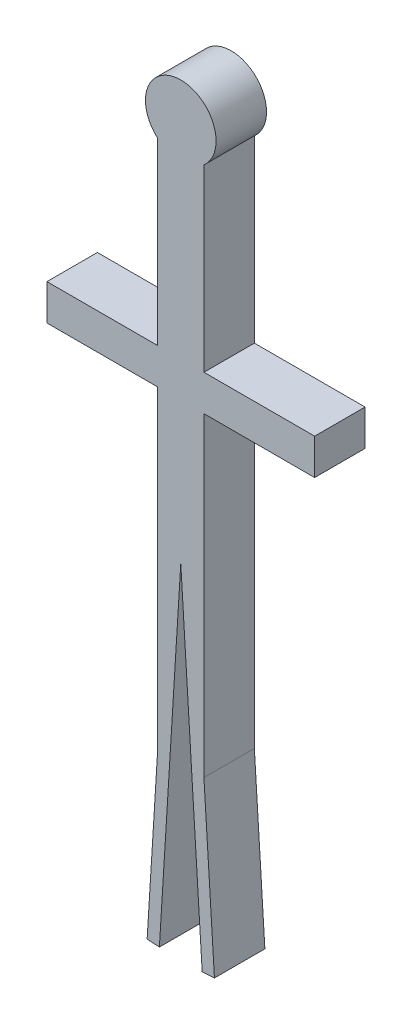
ISO-10303-21;
HEADER;
FILE_DESCRIPTION(('STEP AP214'),'2;1');
FILE_NAME('part.step','',(''),(''),'','','');
FILE_SCHEMA(('AUTOMOTIVE_DESIGN { 1 0 10303 214 1 1 1 1 }'));
ENDSEC;
DATA;
#1=APPLICATION_CONTEXT('core data for automotive mechanical design processes');
#2=APPLICATION_PROTOCOL_DEFINITION('international standard','automotive_design',2000,#1);
#3=PRODUCT_CONTEXT('',#1,'mechanical');
#4=PRODUCT('Part','Part','',(#3));
#5=PRODUCT_RELATED_PRODUCT_CATEGORY('part','',(#4));
#6=PRODUCT_DEFINITION_FORMATION('','',#4);
#7=PRODUCT_DEFINITION_CONTEXT('part definition',#1,'design');
#8=PRODUCT_DEFINITION('design','',#6,#7);
#9=PRODUCT_DEFINITION_SHAPE('','',#8);
#10=(LENGTH_UNIT() NAMED_UNIT(*) SI_UNIT(.MILLI.,.METRE.));
#11=(NAMED_UNIT(*) PLANE_ANGLE_UNIT() SI_UNIT($,.RADIAN.));
#12=(NAMED_UNIT(*) SI_UNIT($,.STERADIAN.) SOLID_ANGLE_UNIT());
#13=UNCERTAINTY_MEASURE_WITH_UNIT(LENGTH_MEASURE(1.E-05),#10,'distance_accuracy_value','');
#14=(GEOMETRIC_REPRESENTATION_CONTEXT(3) GLOBAL_UNCERTAINTY_ASSIGNED_CONTEXT((#13)) GLOBAL_UNIT_ASSIGNED_CONTEXT((#10,
#11,#12)) REPRESENTATION_CONTEXT('',''));
#15=CARTESIAN_POINT('',(0.,0.,0.));
#16=DIRECTION('',(0.,0.,1.));
#17=DIRECTION('',(1.,0.,0.));
#18=AXIS2_PLACEMENT_3D('',#15,#16,#17);
#19=CARTESIAN_POINT('',(0.,0.,127.));
#20=DIRECTION('',(0.,0.,-1.));
#21=DIRECTION('',(-1.,0.,0.));
#22=AXIS2_PLACEMENT_3D('',#19,#20,#21);
#23=CYLINDRICAL_SURFACE('',#22,88.9);
#24=CARTESIAN_POINT('',(0.,0.,0.));
#25=DIRECTION('',(0.,0.,1.));
#26=DIRECTION('',(1.,0.,0.));
#27=AXIS2_PLACEMENT_3D('',#24,#25,#26);
#28=CIRCLE('',#27,88.9);
#29=CARTESIAN_POINT('',(58.2726731385284,-67.1379591981335,0.));
#30=VERTEX_POINT('',#29);
#31=CARTESIAN_POINT('',(-58.2726731385284,-67.1379591981335,0.));
#32=VERTEX_POINT('',#31);
#33=EDGE_CURVE('E183',#30,#32,#28,.T.);
#34=ORIENTED_EDGE('',*,*,#33,.T.);
#35=DIRECTION('',(0.,0.,-1.));
#36=VECTOR('',#35,1.);
#37=CARTESIAN_POINT('',(-58.2726731385284,-67.1379591981335,127.));
#38=LINE('',#37,#36);
#39=CARTESIAN_POINT('',(-58.2726731385284,-67.1379591981335,127.));
#40=VERTEX_POINT('',#39);
#41=EDGE_CURVE('E11',#40,#32,#38,.T.);
#42=ORIENTED_EDGE('',*,*,#41,.F.);
#43=CARTESIAN_POINT('',(0.,0.,127.));
#44=DIRECTION('',(0.,0.,1.));
#45=DIRECTION('',(1.,0.,0.));
#46=AXIS2_PLACEMENT_3D('',#43,#44,#45);
#47=CIRCLE('',#46,88.9);
#48=CARTESIAN_POINT('',(58.2726731385284,-67.1379591981335,127.));
#49=VERTEX_POINT('',#48);
#50=EDGE_CURVE('E215',#49,#40,#47,.T.);
#51=ORIENTED_EDGE('',*,*,#50,.F.);
#52=DIRECTION('',(0.,0.,-1.));
#53=VECTOR('',#52,1.);
#54=CARTESIAN_POINT('',(58.2726731385284,-67.1379591981335,127.));
#55=LINE('',#54,#53);
#56=EDGE_CURVE('E179',#49,#30,#55,.T.);
#57=ORIENTED_EDGE('',*,*,#56,.T.);
#58=EDGE_LOOP('',(#34,#42,#51,#57));
#59=FACE_BOUND('',#58,.T.);
#60=ADVANCED_FACE('F33',(#59),#23,.T.);
#61=CARTESIAN_POINT('',(-58.2726731385284,-67.1379591981335,127.));
#62=DIRECTION('',(1.,0.,0.));
#63=DIRECTION('',(0.,0.,-1.));
#64=AXIS2_PLACEMENT_3D('',#61,#62,#63);
#65=PLANE('',#64);
#66=DIRECTION('',(0.,-1.,0.));
#67=VECTOR('',#66,1.);
#68=CARTESIAN_POINT('',(-58.2726731385284,-67.1379591981335,0.));
#69=LINE('',#68,#67);
#70=CARTESIAN_POINT('',(-58.2726731385284,-519.346809045541,0.));
#71=VERTEX_POINT('',#70);
#72=EDGE_CURVE('E186',#32,#71,#69,.T.);
#73=ORIENTED_EDGE('',*,*,#72,.T.);
#74=DIRECTION('',(0.,0.,-1.));
#75=VECTOR('',#74,1.);
#76=CARTESIAN_POINT('',(-58.2726731385284,-519.346809045541,127.));
#77=LINE('',#76,#75);
#78=CARTESIAN_POINT('',(-58.2726731385284,-519.346809045541,127.));
#79=VERTEX_POINT('',#78);
#80=EDGE_CURVE('E41',#79,#71,#77,.T.);
#81=ORIENTED_EDGE('',*,*,#80,.F.);
#82=DIRECTION('',(0.,-1.,0.));
#83=VECTOR('',#82,1.);
#84=CARTESIAN_POINT('',(-58.2726731385284,-67.1379591981335,127.));
#85=LINE('',#84,#83);
#86=EDGE_CURVE('E119',#40,#79,#85,.T.);
#87=ORIENTED_EDGE('',*,*,#86,.F.);
#88=ORIENTED_EDGE('',*,*,#41,.T.);
#89=EDGE_LOOP('',(#73,#81,#87,#88));
#90=FACE_BOUND('',#89,.T.);
#91=ADVANCED_FACE('F318',(#90),#65,.F.);
#92=CARTESIAN_POINT('',(-58.2726731385284,-519.346809045541,127.));
#93=DIRECTION('',(0.,-1.,0.));
#94=DIRECTION('',(0.,0.,-1.));
#95=AXIS2_PLACEMENT_3D('',#92,#93,#94);
#96=PLANE('',#95);
#97=DIRECTION('',(-1.,0.,0.));
#98=VECTOR('',#97,1.);
#99=CARTESIAN_POINT('',(-58.2726731385284,-519.346809045541,0.));
#100=LINE('',#99,#98);
#101=CARTESIAN_POINT('',(-336.974932068991,-519.346809045541,0.));
#102=VERTEX_POINT('',#101);
#103=EDGE_CURVE('E188',#71,#102,#100,.T.);
#104=ORIENTED_EDGE('',*,*,#103,.T.);
#105=DIRECTION('',(0.,0.,-1.));
#106=VECTOR('',#105,1.);
#107=CARTESIAN_POINT('',(-336.974932068991,-519.346809045541,127.));
#108=LINE('',#107,#106);
#109=CARTESIAN_POINT('',(-336.974932068991,-519.346809045541,127.));
#110=VERTEX_POINT('',#109);
#111=EDGE_CURVE('E249',#110,#102,#108,.T.);
#112=ORIENTED_EDGE('',*,*,#111,.F.);
#113=DIRECTION('',(-1.,0.,0.));
#114=VECTOR('',#113,1.);
#115=CARTESIAN_POINT('',(-58.2726731385284,-519.346809045541,127.));
#116=LINE('',#115,#114);
#117=EDGE_CURVE('E257',#79,#110,#116,.T.);
#118=ORIENTED_EDGE('',*,*,#117,.F.);
#119=ORIENTED_EDGE('',*,*,#80,.T.);
#120=EDGE_LOOP('',(#104,#112,#118,#119));
#121=FACE_BOUND('',#120,.T.);
#122=ADVANCED_FACE('F255',(#121),#96,.F.);
#123=CARTESIAN_POINT('',(-336.974932068991,-519.346809045541,127.));
#124=DIRECTION('',(1.,0.,0.));
#125=DIRECTION('',(0.,0.,-1.));
#126=AXIS2_PLACEMENT_3D('',#123,#124,#125);
#127=PLANE('',#126);
#128=DIRECTION('',(0.,-1.,0.));
#129=VECTOR('',#128,1.);
#130=CARTESIAN_POINT('',(-336.974932068991,-519.346809045541,0.));
#131=LINE('',#130,#129);
#132=CARTESIAN_POINT('',(-336.974932068991,-609.62196558978,0.));
#133=VERTEX_POINT('',#132);
#134=EDGE_CURVE('E190',#102,#133,#131,.T.);
#135=ORIENTED_EDGE('',*,*,#134,.T.);
#136=DIRECTION('',(0.,0.,-1.));
#137=VECTOR('',#136,1.);
#138=CARTESIAN_POINT('',(-336.974932068991,-609.62196558978,127.));
#139=LINE('',#138,#137);
#140=CARTESIAN_POINT('',(-336.974932068991,-609.62196558978,127.));
#141=VERTEX_POINT('',#140);
#142=EDGE_CURVE('E246',#141,#133,#139,.T.);
#143=ORIENTED_EDGE('',*,*,#142,.F.);
#144=DIRECTION('',(0.,-1.,0.));
#145=VECTOR('',#144,1.);
#146=CARTESIAN_POINT('',(-336.974932068991,-519.346809045541,127.));
#147=LINE('',#146,#145);
#148=EDGE_CURVE('E275',#110,#141,#147,.T.);
#149=ORIENTED_EDGE('',*,*,#148,.F.);
#150=ORIENTED_EDGE('',*,*,#111,.T.);
#151=EDGE_LOOP('',(#135,#143,#149,#150));
#152=FACE_BOUND('',#151,.T.);
#153=ADVANCED_FACE('F266',(#152),#127,.F.);
#154=CARTESIAN_POINT('',(-336.974932068991,-609.62196558978,127.));
#155=DIRECTION('',(0.,1.,0.));
#156=DIRECTION('',(0.,0.,1.));
#157=AXIS2_PLACEMENT_3D('',#154,#155,#156);
#158=PLANE('',#157);
#159=DIRECTION('',(1.,0.,0.));
#160=VECTOR('',#159,1.);
#161=CARTESIAN_POINT('',(-336.974932068991,-609.62196558978,0.));
#162=LINE('',#161,#160);
#163=CARTESIAN_POINT('',(-58.2726731385284,-609.62196558978,0.));
#164=VERTEX_POINT('',#163);
#165=EDGE_CURVE('E192',#133,#164,#162,.T.);
#166=ORIENTED_EDGE('',*,*,#165,.T.);
#167=DIRECTION('',(0.,0.,-1.));
#168=VECTOR('',#167,1.);
#169=CARTESIAN_POINT('',(-58.2726731385284,-609.62196558978,127.));
#170=LINE('',#169,#168);
#171=CARTESIAN_POINT('',(-58.2726731385284,-609.62196558978,127.));
#172=VERTEX_POINT('',#171);
#173=EDGE_CURVE('E243',#172,#164,#170,.T.);
#174=ORIENTED_EDGE('',*,*,#173,.F.);
#175=DIRECTION('',(1.,0.,0.));
#176=VECTOR('',#175,1.);
#177=CARTESIAN_POINT('',(-336.974932068991,-609.62196558978,127.));
#178=LINE('',#177,#176);
#179=EDGE_CURVE('E272',#141,#172,#178,.T.);
#180=ORIENTED_EDGE('',*,*,#179,.F.);
#181=ORIENTED_EDGE('',*,*,#142,.T.);
#182=EDGE_LOOP('',(#166,#174,#180,#181));
#183=FACE_BOUND('',#182,.T.);
#184=ADVANCED_FACE('F270',(#183),#158,.F.);
#185=CARTESIAN_POINT('',(-58.2726731385284,-609.62196558978,127.));
#186=DIRECTION('',(1.,0.,0.));
#187=DIRECTION('',(0.,1.,0.));
#188=AXIS2_PLACEMENT_3D('',#185,#186,#187);
#189=PLANE('',#188);
#190=DIRECTION('',(0.,-1.,0.));
#191=VECTOR('',#190,1.);
#192=CARTESIAN_POINT('',(-58.2726731385284,-609.62196558978,0.));
#193=LINE('',#192,#191);
#194=CARTESIAN_POINT('',(-58.2726731385282,-1403.11866405035,0.));
#195=VERTEX_POINT('',#194);
#196=EDGE_CURVE('E194',#164,#195,#193,.T.);
#197=ORIENTED_EDGE('',*,*,#196,.T.);
#198=DIRECTION('',(0.,0.,-1.));
#199=VECTOR('',#198,1.);
#200=CARTESIAN_POINT('',(-58.2726731385282,-1403.11866405035,127.));
#201=LINE('',#200,#199);
#202=CARTESIAN_POINT('',(-58.2726731385282,-1403.11866405035,127.));
#203=VERTEX_POINT('',#202);
#204=EDGE_CURVE('E240',#203,#195,#201,.T.);
#205=ORIENTED_EDGE('',*,*,#204,.F.);
#206=DIRECTION('',(0.,-1.,0.));
#207=VECTOR('',#206,1.);
#208=CARTESIAN_POINT('',(-58.2726731385284,-609.62196558978,127.));
#209=LINE('',#208,#207);
#210=EDGE_CURVE('E274',#172,#203,#209,.T.);
#211=ORIENTED_EDGE('',*,*,#210,.F.);
#212=ORIENTED_EDGE('',*,*,#173,.T.);
#213=EDGE_LOOP('',(#197,#205,#211,#212));
#214=FACE_BOUND('',#213,.T.);
#215=ADVANCED_FACE('F331',(#214),#189,.F.);
#216=CARTESIAN_POINT('',(-58.2726731385282,-1403.11866405035,127.));
#217=DIRECTION('',(0.998056580707022,-0.0623142175382735,0.));
#218=DIRECTION('',(0.0623142175382735,0.998056580707022,0.));
#219=AXIS2_PLACEMENT_3D('',#216,#217,#218);
#220=PLANE('',#219);
#221=DIRECTION('',(-0.0623142175382735,-0.998056580707022,0.));
#222=VECTOR('',#221,1.);
#223=CARTESIAN_POINT('',(-58.2726731385282,-1403.11866405035,0.));
#224=LINE('',#223,#222);
#225=CARTESIAN_POINT('',(-84.7301029401742,-1826.87447717451,0.));
#226=VERTEX_POINT('',#225);
#227=EDGE_CURVE('E196',#195,#226,#224,.T.);
#228=ORIENTED_EDGE('',*,*,#227,.T.);
#229=DIRECTION('',(0.,0.,-1.));
#230=VECTOR('',#229,1.);
#231=CARTESIAN_POINT('',(-84.7301029401742,-1826.87447717451,127.));
#232=LINE('',#231,#230);
#233=CARTESIAN_POINT('',(-84.7301029401742,-1826.87447717451,127.));
#234=VERTEX_POINT('',#233);
#235=EDGE_CURVE('E237',#234,#226,#232,.T.);
#236=ORIENTED_EDGE('',*,*,#235,.F.);
#237=DIRECTION('',(-0.0623142175382735,-0.998056580707022,0.));
#238=VECTOR('',#237,1.);
#239=CARTESIAN_POINT('',(-58.2726731385282,-1403.11866405035,127.));
#240=LINE('',#239,#238);
#241=EDGE_CURVE('E277',#203,#234,#240,.T.);
#242=ORIENTED_EDGE('',*,*,#241,.F.);
#243=ORIENTED_EDGE('',*,*,#204,.T.);
#244=EDGE_LOOP('',(#228,#236,#242,#243));
#245=FACE_BOUND('',#244,.T.);
#246=ADVANCED_FACE('F334',(#245),#220,.F.);
#247=CARTESIAN_POINT('',(-84.7301029401742,-1826.87447717451,127.));
#248=DIRECTION('',(0.0623142175382751,0.998056580707022,0.));
#249=DIRECTION('',(-0.998056580707022,0.0623142175382751,0.));
#250=AXIS2_PLACEMENT_3D('',#247,#248,#249);
#251=PLANE('',#250);
#252=DIRECTION('',(0.998056580707022,-0.0623142175382751,0.));
#253=VECTOR('',#252,1.);
#254=CARTESIAN_POINT('',(-84.7301029401742,-1826.87447717451,0.));
#255=LINE('',#254,#253);
#256=CARTESIAN_POINT('',(-53.8899383163327,-1828.8,0.));
#257=VERTEX_POINT('',#256);
#258=EDGE_CURVE('E198',#226,#257,#255,.T.);
#259=ORIENTED_EDGE('',*,*,#258,.T.);
#260=DIRECTION('',(0.,0.,-1.));
#261=VECTOR('',#260,1.);
#262=CARTESIAN_POINT('',(-53.8899383163327,-1828.8,127.));
#263=LINE('',#262,#261);
#264=CARTESIAN_POINT('',(-53.8899383163327,-1828.8,127.));
#265=VERTEX_POINT('',#264);
#266=EDGE_CURVE('E234',#265,#257,#263,.T.);
#267=ORIENTED_EDGE('',*,*,#266,.F.);
#268=DIRECTION('',(0.998056580707022,-0.0623142175382751,0.));
#269=VECTOR('',#268,1.);
#270=CARTESIAN_POINT('',(-84.7301029401742,-1826.87447717451,127.));
#271=LINE('',#270,#269);
#272=EDGE_CURVE('E283',#234,#265,#271,.T.);
#273=ORIENTED_EDGE('',*,*,#272,.F.);
#274=ORIENTED_EDGE('',*,*,#235,.T.);
#275=EDGE_LOOP('',(#259,#267,#273,#274));
#276=FACE_BOUND('',#275,.T.);
#277=ADVANCED_FACE('F338',(#276),#251,.F.);
#278=CARTESIAN_POINT('',(-53.8899383163327,-1828.8,127.));
#279=DIRECTION('',(-0.998056580707022,0.0623142175382737,0.));
#280=DIRECTION('',(-0.0623142175382737,-0.998056580707022,0.));
#281=AXIS2_PLACEMENT_3D('',#278,#279,#280);
#282=PLANE('',#281);
#283=DIRECTION('',(0.0623142175382737,0.998056580707022,0.));
#284=VECTOR('',#283,1.);
#285=CARTESIAN_POINT('',(-53.8899383163327,-1828.8,0.));
#286=LINE('',#285,#284);
#287=CARTESIAN_POINT('',(0.,-965.671011218647,0.));
#288=VERTEX_POINT('',#287);
#289=EDGE_CURVE('E200',#257,#288,#286,.T.);
#290=ORIENTED_EDGE('',*,*,#289,.T.);
#291=DIRECTION('',(0.,0.,-1.));
#292=VECTOR('',#291,1.);
#293=CARTESIAN_POINT('',(0.,-965.671011218647,127.));
#294=LINE('',#293,#292);
#295=CARTESIAN_POINT('',(0.,-965.671011218647,127.));
#296=VERTEX_POINT('',#295);
#297=EDGE_CURVE('E231',#296,#288,#294,.T.);
#298=ORIENTED_EDGE('',*,*,#297,.F.);
#299=DIRECTION('',(0.0623142175382737,0.998056580707022,0.));
#300=VECTOR('',#299,1.);
#301=CARTESIAN_POINT('',(-53.8899383163327,-1828.8,127.));
#302=LINE('',#301,#300);
#303=EDGE_CURVE('E285',#265,#296,#302,.T.);
#304=ORIENTED_EDGE('',*,*,#303,.F.);
#305=ORIENTED_EDGE('',*,*,#266,.T.);
#306=EDGE_LOOP('',(#290,#298,#304,#305));
#307=FACE_BOUND('',#306,.T.);
#308=ADVANCED_FACE('F342',(#307),#282,.F.);
#309=CARTESIAN_POINT('',(0.,-965.671011218647,127.));
#310=DIRECTION('',(0.998056580707022,0.0623142175382742,0.));
#311=DIRECTION('',(-0.0623142175382742,0.998056580707022,0.));
#312=AXIS2_PLACEMENT_3D('',#309,#310,#311);
#313=PLANE('',#312);
#314=DIRECTION('',(0.0623142175382742,-0.998056580707022,0.));
#315=VECTOR('',#314,1.);
#316=CARTESIAN_POINT('',(0.,-965.671011218647,0.));
#317=LINE('',#316,#315);
#318=CARTESIAN_POINT('',(53.8899383163332,-1828.8,0.));
#319=VERTEX_POINT('',#318);
#320=EDGE_CURVE('E202',#288,#319,#317,.T.);
#321=ORIENTED_EDGE('',*,*,#320,.T.);
#322=DIRECTION('',(0.,0.,-1.));
#323=VECTOR('',#322,1.);
#324=CARTESIAN_POINT('',(53.8899383163332,-1828.8,127.));
#325=LINE('',#324,#323);
#326=CARTESIAN_POINT('',(53.8899383163332,-1828.8,127.));
#327=VERTEX_POINT('',#326);
#328=EDGE_CURVE('E228',#327,#319,#325,.T.);
#329=ORIENTED_EDGE('',*,*,#328,.F.);
#330=DIRECTION('',(0.0623142175382742,-0.998056580707022,0.));
#331=VECTOR('',#330,1.);
#332=CARTESIAN_POINT('',(0.,-965.671011218647,127.));
#333=LINE('',#332,#331);
#334=EDGE_CURVE('E287',#296,#327,#333,.T.);
#335=ORIENTED_EDGE('',*,*,#334,.F.);
#336=ORIENTED_EDGE('',*,*,#297,.T.);
#337=EDGE_LOOP('',(#321,#329,#335,#336));
#338=FACE_BOUND('',#337,.T.);
#339=ADVANCED_FACE('F346',(#338),#313,.F.);
#340=CARTESIAN_POINT('',(53.8899383163332,-1828.8,127.));
#341=DIRECTION('',(-0.0623142175382761,0.998056580707022,0.));
#342=DIRECTION('',(-0.998056580707022,-0.0623142175382761,0.));
#343=AXIS2_PLACEMENT_3D('',#340,#341,#342);
#344=PLANE('',#343);
#345=DIRECTION('',(0.998056580707022,0.0623142175382761,0.));
#346=VECTOR('',#345,1.);
#347=CARTESIAN_POINT('',(53.8899383163332,-1828.8,0.));
#348=LINE('',#347,#346);
#349=CARTESIAN_POINT('',(84.7301029401742,-1826.87447717451,0.));
#350=VERTEX_POINT('',#349);
#351=EDGE_CURVE('E204',#319,#350,#348,.T.);
#352=ORIENTED_EDGE('',*,*,#351,.T.);
#353=DIRECTION('',(0.,0.,-1.));
#354=VECTOR('',#353,1.);
#355=CARTESIAN_POINT('',(84.7301029401742,-1826.87447717451,127.));
#356=LINE('',#355,#354);
#357=CARTESIAN_POINT('',(84.7301029401742,-1826.87447717451,127.));
#358=VERTEX_POINT('',#357);
#359=EDGE_CURVE('E225',#358,#350,#356,.T.);
#360=ORIENTED_EDGE('',*,*,#359,.F.);
#361=DIRECTION('',(0.998056580707022,0.0623142175382761,0.));
#362=VECTOR('',#361,1.);
#363=CARTESIAN_POINT('',(53.8899383163332,-1828.8,127.));
#364=LINE('',#363,#362);
#365=EDGE_CURVE('E289',#327,#358,#364,.T.);
#366=ORIENTED_EDGE('',*,*,#365,.F.);
#367=ORIENTED_EDGE('',*,*,#328,.T.);
#368=EDGE_LOOP('',(#352,#360,#366,#367));
#369=FACE_BOUND('',#368,.T.);
#370=ADVANCED_FACE('F350',(#369),#344,.F.);
#371=CARTESIAN_POINT('',(84.7301029401742,-1826.87447717451,127.));
#372=DIRECTION('',(-0.998056580707022,-0.0623142175382735,0.));
#373=DIRECTION('',(0.0623142175382735,-0.998056580707022,0.));
#374=AXIS2_PLACEMENT_3D('',#371,#372,#373);
#375=PLANE('',#374);
#376=DIRECTION('',(-0.0623142175382735,0.998056580707022,0.));
#377=VECTOR('',#376,1.);
#378=CARTESIAN_POINT('',(84.7301029401742,-1826.87447717451,0.));
#379=LINE('',#378,#377);
#380=CARTESIAN_POINT('',(58.2726731385282,-1403.11866405035,0.));
#381=VERTEX_POINT('',#380);
#382=EDGE_CURVE('E206',#350,#381,#379,.T.);
#383=ORIENTED_EDGE('',*,*,#382,.T.);
#384=DIRECTION('',(0.,0.,-1.));
#385=VECTOR('',#384,1.);
#386=CARTESIAN_POINT('',(58.2726731385282,-1403.11866405035,127.));
#387=LINE('',#386,#385);
#388=CARTESIAN_POINT('',(58.2726731385282,-1403.11866405035,127.));
#389=VERTEX_POINT('',#388);
#390=EDGE_CURVE('E222',#389,#381,#387,.T.);
#391=ORIENTED_EDGE('',*,*,#390,.F.);
#392=DIRECTION('',(-0.0623142175382735,0.998056580707022,0.));
#393=VECTOR('',#392,1.);
#394=CARTESIAN_POINT('',(84.7301029401742,-1826.87447717451,127.));
#395=LINE('',#394,#393);
#396=EDGE_CURVE('E291',#358,#389,#395,.T.);
#397=ORIENTED_EDGE('',*,*,#396,.F.);
#398=ORIENTED_EDGE('',*,*,#359,.T.);
#399=EDGE_LOOP('',(#383,#391,#397,#398));
#400=FACE_BOUND('',#399,.T.);
#401=ADVANCED_FACE('F354',(#400),#375,.F.);
#402=CARTESIAN_POINT('',(58.2726731385282,-1403.11866405035,127.));
#403=DIRECTION('',(-1.,0.,0.));
#404=DIRECTION('',(0.,-1.,0.));
#405=AXIS2_PLACEMENT_3D('',#402,#403,#404);
#406=PLANE('',#405);
#407=DIRECTION('',(0.,1.,0.));
#408=VECTOR('',#407,1.);
#409=CARTESIAN_POINT('',(58.2726731385282,-1403.11866405035,0.));
#410=LINE('',#409,#408);
#411=CARTESIAN_POINT('',(58.2726731385284,-609.62196558978,0.));
#412=VERTEX_POINT('',#411);
#413=EDGE_CURVE('E208',#381,#412,#410,.T.);
#414=ORIENTED_EDGE('',*,*,#413,.T.);
#415=DIRECTION('',(0.,0.,-1.));
#416=VECTOR('',#415,1.);
#417=CARTESIAN_POINT('',(58.2726731385284,-609.62196558978,127.));
#418=LINE('',#417,#416);
#419=CARTESIAN_POINT('',(58.2726731385284,-609.62196558978,127.));
#420=VERTEX_POINT('',#419);
#421=EDGE_CURVE('E219',#420,#412,#418,.T.);
#422=ORIENTED_EDGE('',*,*,#421,.F.);
#423=DIRECTION('',(0.,1.,0.));
#424=VECTOR('',#423,1.);
#425=CARTESIAN_POINT('',(58.2726731385282,-1403.11866405035,127.));
#426=LINE('',#425,#424);
#427=EDGE_CURVE('E293',#389,#420,#426,.T.);
#428=ORIENTED_EDGE('',*,*,#427,.F.);
#429=ORIENTED_EDGE('',*,*,#390,.T.);
#430=EDGE_LOOP('',(#414,#422,#428,#429));
#431=FACE_BOUND('',#430,.T.);
#432=ADVANCED_FACE('F299',(#431),#406,.F.);
#433=CARTESIAN_POINT('',(58.2726731385284,-609.62196558978,127.));
#434=DIRECTION('',(0.,1.,0.));
#435=DIRECTION('',(0.,0.,1.));
#436=AXIS2_PLACEMENT_3D('',#433,#434,#435);
#437=PLANE('',#436);
#438=DIRECTION('',(1.,0.,0.));
#439=VECTOR('',#438,1.);
#440=CARTESIAN_POINT('',(58.2726731385284,-609.62196558978,0.));
#441=LINE('',#440,#439);
#442=CARTESIAN_POINT('',(336.974932068991,-609.62196558978,0.));
#443=VERTEX_POINT('',#442);
#444=EDGE_CURVE('E210',#412,#443,#441,.T.);
#445=ORIENTED_EDGE('',*,*,#444,.T.);
#446=DIRECTION('',(0.,0.,-1.));
#447=VECTOR('',#446,1.);
#448=CARTESIAN_POINT('',(336.974932068991,-609.62196558978,127.));
#449=LINE('',#448,#447);
#450=CARTESIAN_POINT('',(336.974932068991,-609.62196558978,127.));
#451=VERTEX_POINT('',#450);
#452=EDGE_CURVE('E174',#451,#443,#449,.T.);
#453=ORIENTED_EDGE('',*,*,#452,.F.);
#454=DIRECTION('',(1.,0.,0.));
#455=VECTOR('',#454,1.);
#456=CARTESIAN_POINT('',(58.2726731385284,-609.62196558978,127.));
#457=LINE('',#456,#455);
#458=EDGE_CURVE('E165',#420,#451,#457,.T.);
#459=ORIENTED_EDGE('',*,*,#458,.F.);
#460=ORIENTED_EDGE('',*,*,#421,.T.);
#461=EDGE_LOOP('',(#445,#453,#459,#460));
#462=FACE_BOUND('',#461,.T.);
#463=ADVANCED_FACE('F303',(#462),#437,.F.);
#464=CARTESIAN_POINT('',(336.974932068991,-609.62196558978,127.));
#465=DIRECTION('',(-1.,0.,0.));
#466=DIRECTION('',(0.,0.,1.));
#467=AXIS2_PLACEMENT_3D('',#464,#465,#466);
#468=PLANE('',#467);
#469=DIRECTION('',(0.,1.,0.));
#470=VECTOR('',#469,1.);
#471=CARTESIAN_POINT('',(336.974932068991,-609.62196558978,0.));
#472=LINE('',#471,#470);
#473=CARTESIAN_POINT('',(336.974932068991,-519.346809045541,0.));
#474=VERTEX_POINT('',#473);
#475=EDGE_CURVE('E173',#443,#474,#472,.T.);
#476=ORIENTED_EDGE('',*,*,#475,.T.);
#477=DIRECTION('',(0.,0.,-1.));
#478=VECTOR('',#477,1.);
#479=CARTESIAN_POINT('',(336.974932068991,-519.346809045541,127.));
#480=LINE('',#479,#478);
#481=CARTESIAN_POINT('',(336.974932068991,-519.346809045541,127.));
#482=VERTEX_POINT('',#481);
#483=EDGE_CURVE('E170',#482,#474,#480,.T.);
#484=ORIENTED_EDGE('',*,*,#483,.F.);
#485=DIRECTION('',(0.,1.,0.));
#486=VECTOR('',#485,1.);
#487=CARTESIAN_POINT('',(336.974932068991,-609.62196558978,127.));
#488=LINE('',#487,#486);
#489=EDGE_CURVE('E159',#451,#482,#488,.T.);
#490=ORIENTED_EDGE('',*,*,#489,.F.);
#491=ORIENTED_EDGE('',*,*,#452,.T.);
#492=EDGE_LOOP('',(#476,#484,#490,#491));
#493=FACE_BOUND('',#492,.T.);
#494=ADVANCED_FACE('F171',(#493),#468,.F.);
#495=CARTESIAN_POINT('',(336.974932068991,-519.346809045541,127.));
#496=DIRECTION('',(0.,-1.,0.));
#497=DIRECTION('',(0.,0.,-1.));
#498=AXIS2_PLACEMENT_3D('',#495,#496,#497);
#499=PLANE('',#498);
#500=DIRECTION('',(-1.,0.,0.));
#501=VECTOR('',#500,1.);
#502=CARTESIAN_POINT('',(336.974932068991,-519.346809045541,0.));
#503=LINE('',#502,#501);
#504=CARTESIAN_POINT('',(58.2726731385284,-519.346809045541,0.));
#505=VERTEX_POINT('',#504);
#506=EDGE_CURVE('E105',#474,#505,#503,.T.);
#507=ORIENTED_EDGE('',*,*,#506,.T.);
#508=DIRECTION('',(0.,0.,-1.));
#509=VECTOR('',#508,1.);
#510=CARTESIAN_POINT('',(58.2726731385284,-519.346809045541,127.));
#511=LINE('',#510,#509);
#512=CARTESIAN_POINT('',(58.2726731385284,-519.346809045541,127.));
#513=VERTEX_POINT('',#512);
#514=EDGE_CURVE('E175',#513,#505,#511,.T.);
#515=ORIENTED_EDGE('',*,*,#514,.F.);
#516=DIRECTION('',(-1.,0.,0.));
#517=VECTOR('',#516,1.);
#518=CARTESIAN_POINT('',(336.974932068991,-519.346809045541,127.));
#519=LINE('',#518,#517);
#520=EDGE_CURVE('E163',#482,#513,#519,.T.);
#521=ORIENTED_EDGE('',*,*,#520,.F.);
#522=ORIENTED_EDGE('',*,*,#483,.T.);
#523=EDGE_LOOP('',(#507,#515,#521,#522));
#524=FACE_BOUND('',#523,.T.);
#525=ADVANCED_FACE('F177',(#524),#499,.F.);
#526=CARTESIAN_POINT('',(58.2726731385284,-519.346809045541,127.));
#527=DIRECTION('',(-1.,0.,0.));
#528=DIRECTION('',(0.,0.,1.));
#529=AXIS2_PLACEMENT_3D('',#526,#527,#528);
#530=PLANE('',#529);
#531=DIRECTION('',(0.,1.,0.));
#532=VECTOR('',#531,1.);
#533=CARTESIAN_POINT('',(58.2726731385284,-519.346809045541,0.));
#534=LINE('',#533,#532);
#535=EDGE_CURVE('E111',#505,#30,#534,.T.);
#536=ORIENTED_EDGE('',*,*,#535,.T.);
#537=ORIENTED_EDGE('',*,*,#56,.F.);
#538=DIRECTION('',(0.,1.,0.));
#539=VECTOR('',#538,1.);
#540=CARTESIAN_POINT('',(58.2726731385284,-519.346809045541,127.));
#541=LINE('',#540,#539);
#542=EDGE_CURVE('E49',#513,#49,#541,.T.);
#543=ORIENTED_EDGE('',*,*,#542,.F.);
#544=ORIENTED_EDGE('',*,*,#514,.T.);
#545=EDGE_LOOP('',(#536,#537,#543,#544));
#546=FACE_BOUND('',#545,.T.);
#547=ADVANCED_FACE('F307',(#546),#530,.F.);
#548=CARTESIAN_POINT('',(0.,0.,127.));
#549=DIRECTION('',(0.,0.,1.));
#550=DIRECTION('',(1.,0.,0.));
#551=AXIS2_PLACEMENT_3D('',#548,#549,#550);
#552=PLANE('',#551);
#553=ORIENTED_EDGE('',*,*,#50,.T.);
#554=ORIENTED_EDGE('',*,*,#86,.T.);
#555=ORIENTED_EDGE('',*,*,#117,.T.);
#556=ORIENTED_EDGE('',*,*,#148,.T.);
#557=ORIENTED_EDGE('',*,*,#179,.T.);
#558=ORIENTED_EDGE('',*,*,#210,.T.);
#559=ORIENTED_EDGE('',*,*,#241,.T.);
#560=ORIENTED_EDGE('',*,*,#272,.T.);
#561=ORIENTED_EDGE('',*,*,#303,.T.);
#562=ORIENTED_EDGE('',*,*,#334,.T.);
#563=ORIENTED_EDGE('',*,*,#365,.T.);
#564=ORIENTED_EDGE('',*,*,#396,.T.);
#565=ORIENTED_EDGE('',*,*,#427,.T.);
#566=ORIENTED_EDGE('',*,*,#458,.T.);
#567=ORIENTED_EDGE('',*,*,#489,.T.);
#568=ORIENTED_EDGE('',*,*,#520,.T.);
#569=ORIENTED_EDGE('',*,*,#542,.T.);
#570=EDGE_LOOP('',(#553,#554,#555,#556,#557,#558,#559,#560,#561,#562,#563,#564,#565,#566,#567,
#568,#569));
#571=FACE_BOUND('',#570,.T.);
#572=ADVANCED_FACE('F161',(#571),#552,.T.);
#573=CARTESIAN_POINT('',(0.,0.,0.));
#574=DIRECTION('',(0.,0.,1.));
#575=DIRECTION('',(1.,0.,0.));
#576=AXIS2_PLACEMENT_3D('',#573,#574,#575);
#577=PLANE('',#576);
#578=ORIENTED_EDGE('',*,*,#33,.F.);
#579=ORIENTED_EDGE('',*,*,#535,.F.);
#580=ORIENTED_EDGE('',*,*,#506,.F.);
#581=ORIENTED_EDGE('',*,*,#475,.F.);
#582=ORIENTED_EDGE('',*,*,#444,.F.);
#583=ORIENTED_EDGE('',*,*,#413,.F.);
#584=ORIENTED_EDGE('',*,*,#382,.F.);
#585=ORIENTED_EDGE('',*,*,#351,.F.);
#586=ORIENTED_EDGE('',*,*,#320,.F.);
#587=ORIENTED_EDGE('',*,*,#289,.F.);
#588=ORIENTED_EDGE('',*,*,#258,.F.);
#589=ORIENTED_EDGE('',*,*,#227,.F.);
#590=ORIENTED_EDGE('',*,*,#196,.F.);
#591=ORIENTED_EDGE('',*,*,#165,.F.);
#592=ORIENTED_EDGE('',*,*,#134,.F.);
#593=ORIENTED_EDGE('',*,*,#103,.F.);
#594=ORIENTED_EDGE('',*,*,#72,.F.);
#595=EDGE_LOOP('',(#578,#579,#580,#581,#582,#583,#584,#585,#586,#587,#588,#589,#590,#591,#592,
#593,#594));
#596=FACE_BOUND('',#595,.T.);
#597=ADVANCED_FACE('F261',(#596),#577,.F.);
#598=CLOSED_SHELL('',(#60,#91,#122,#153,#184,#215,#246,#277,#308,#339,#370,#401,#432,#463,#494,
#525,#547,#572,#597));
#599=MANIFOLD_SOLID_BREP('B2',#598);
#600=ADVANCED_BREP_SHAPE_REPRESENTATION('',(#18,#599),#14);
#601=SHAPE_DEFINITION_REPRESENTATION(#9,#600);
ENDSEC;
END-ISO-10303-21;
